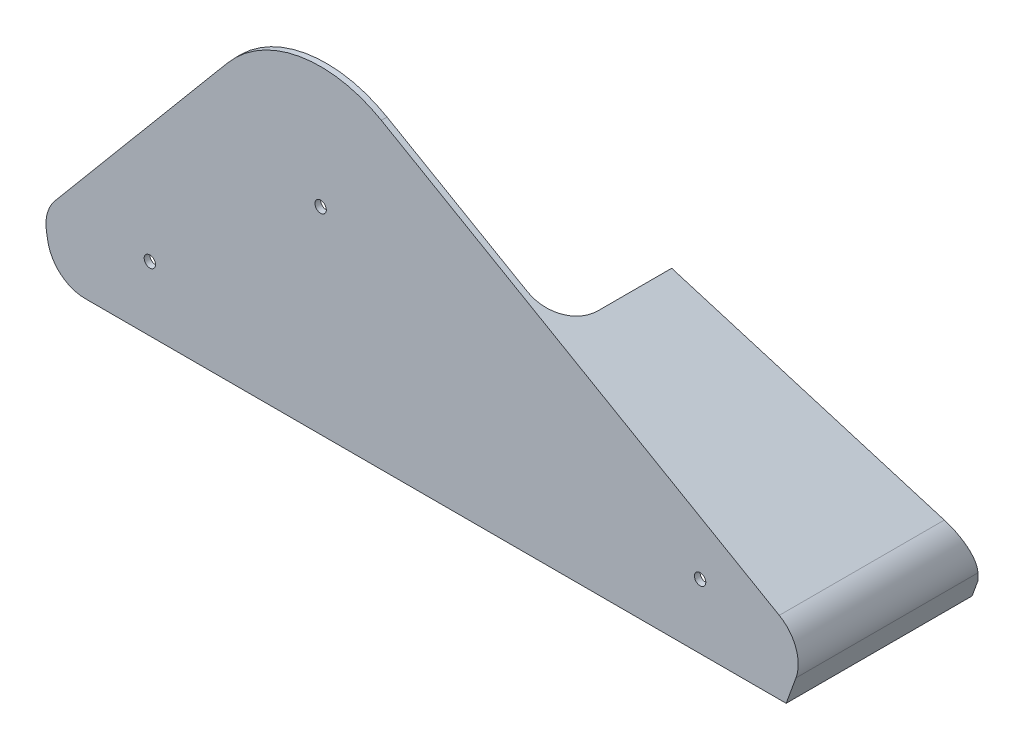
ISO-10303-21;
HEADER;
FILE_DESCRIPTION(('STEP AP214'),'2;1');
FILE_NAME('part.step','',(''),(''),'','','');
FILE_SCHEMA(('AUTOMOTIVE_DESIGN { 1 0 10303 214 1 1 1 1 }'));
ENDSEC;
DATA;
#1=APPLICATION_CONTEXT('core data for automotive mechanical design processes');
#2=APPLICATION_PROTOCOL_DEFINITION('international standard','automotive_design',2000,#1);
#3=PRODUCT_CONTEXT('',#1,'mechanical');
#4=PRODUCT('Part','Part','',(#3));
#5=PRODUCT_RELATED_PRODUCT_CATEGORY('part','',(#4));
#6=PRODUCT_DEFINITION_FORMATION('','',#4);
#7=PRODUCT_DEFINITION_CONTEXT('part definition',#1,'design');
#8=PRODUCT_DEFINITION('design','',#6,#7);
#9=PRODUCT_DEFINITION_SHAPE('','',#8);
#10=(LENGTH_UNIT() NAMED_UNIT(*) SI_UNIT(.MILLI.,.METRE.));
#11=(NAMED_UNIT(*) PLANE_ANGLE_UNIT() SI_UNIT($,.RADIAN.));
#12=(NAMED_UNIT(*) SI_UNIT($,.STERADIAN.) SOLID_ANGLE_UNIT());
#13=UNCERTAINTY_MEASURE_WITH_UNIT(LENGTH_MEASURE(1.E-05),#10,'distance_accuracy_value','');
#14=(GEOMETRIC_REPRESENTATION_CONTEXT(3) GLOBAL_UNCERTAINTY_ASSIGNED_CONTEXT((#13)) GLOBAL_UNIT_ASSIGNED_CONTEXT((#10,
#11,#12)) REPRESENTATION_CONTEXT('',''));
#15=CARTESIAN_POINT('',(0.,0.,0.));
#16=DIRECTION('',(0.,0.,1.));
#17=DIRECTION('',(1.,0.,0.));
#18=AXIS2_PLACEMENT_3D('',#15,#16,#17);
#19=CARTESIAN_POINT('',(-41.9752973417695,-243.681845607916,-46.));
#20=DIRECTION('',(0.,1.,0.));
#21=DIRECTION('',(0.,0.,-1.));
#22=AXIS2_PLACEMENT_3D('',#19,#20,#21);
#23=PLANE('',#22);
#24=DIRECTION('',(1.,0.,0.));
#25=VECTOR('',#24,1.);
#26=CARTESIAN_POINT('',(-41.9752973417695,-243.681845607916,-47.5));
#27=LINE('',#26,#25);
#28=CARTESIAN_POINT('',(-118.598691665262,-243.681845607916,-47.5));
#29=VERTEX_POINT('',#28);
#30=CARTESIAN_POINT('',(-40.3790306830556,-243.681845607916,-47.5));
#31=VERTEX_POINT('',#30);
#32=EDGE_CURVE('E218',#29,#31,#27,.T.);
#33=ORIENTED_EDGE('',*,*,#32,.T.);
#34=DIRECTION('',(0.,0.,1.));
#35=VECTOR('',#34,1.);
#36=CARTESIAN_POINT('',(-40.3790306830556,-243.681845607916,-46.));
#37=LINE('',#36,#35);
#38=CARTESIAN_POINT('',(-40.3790306830556,-243.681845607916,1.5));
#39=VERTEX_POINT('',#38);
#40=EDGE_CURVE('E230',#31,#39,#37,.T.);
#41=ORIENTED_EDGE('',*,*,#40,.T.);
#42=DIRECTION('',(1.,0.,0.));
#43=VECTOR('',#42,1.);
#44=CARTESIAN_POINT('',(-41.9752973417695,-243.681845607916,1.5));
#45=LINE('',#44,#43);
#46=CARTESIAN_POINT('',(-225.107440947825,-243.681845607916,1.5));
#47=VERTEX_POINT('',#46);
#48=EDGE_CURVE('E223',#47,#39,#45,.T.);
#49=ORIENTED_EDGE('',*,*,#48,.F.);
#50=DIRECTION('',(0.,0.,1.));
#51=VECTOR('',#50,1.);
#52=CARTESIAN_POINT('',(-225.107440947825,-243.681845607916,-46.));
#53=LINE('',#52,#51);
#54=CARTESIAN_POINT('',(-225.107440947825,-243.681845607916,0.));
#55=VERTEX_POINT('',#54);
#56=EDGE_CURVE('E261',#55,#47,#53,.T.);
#57=ORIENTED_EDGE('',*,*,#56,.F.);
#58=DIRECTION('',(1.,0.,0.));
#59=VECTOR('',#58,1.);
#60=CARTESIAN_POINT('',(-41.9752973417695,-243.681845607916,0.));
#61=LINE('',#60,#59);
#62=CARTESIAN_POINT('',(-41.9752973417695,-243.681845607916,0.));
#63=VERTEX_POINT('',#62);
#64=EDGE_CURVE('E357',#55,#63,#61,.T.);
#65=ORIENTED_EDGE('',*,*,#64,.T.);
#66=DIRECTION('',(0.,0.,1.));
#67=VECTOR('',#66,1.);
#68=CARTESIAN_POINT('',(-41.9752973417695,-243.681845607916,-46.));
#69=LINE('',#68,#67);
#70=CARTESIAN_POINT('',(-41.9752973417695,-243.681845607916,-46.));
#71=VERTEX_POINT('',#70);
#72=EDGE_CURVE('E205',#71,#63,#69,.T.);
#73=ORIENTED_EDGE('',*,*,#72,.F.);
#74=DIRECTION('',(1.,0.,0.));
#75=VECTOR('',#74,1.);
#76=CARTESIAN_POINT('',(-41.9752973417695,-243.681845607916,-46.));
#77=LINE('',#76,#75);
#78=CARTESIAN_POINT('',(-118.598691665262,-243.681845607916,-46.));
#79=VERTEX_POINT('',#78);
#80=EDGE_CURVE('E358',#79,#71,#77,.T.);
#81=ORIENTED_EDGE('',*,*,#80,.F.);
#82=DIRECTION('',(0.,0.,1.));
#83=VECTOR('',#82,1.);
#84=CARTESIAN_POINT('',(-118.598691665262,-243.681845607916,-46.));
#85=LINE('',#84,#83);
#86=EDGE_CURVE('E281',#29,#79,#85,.T.);
#87=ORIENTED_EDGE('',*,*,#86,.F.);
#88=EDGE_LOOP('',(#33,#41,#49,#57,#65,#73,#81,#87));
#89=FACE_BOUND('',#88,.T.);
#90=ADVANCED_FACE('F41',(#89),#23,.F.);
#91=CARTESIAN_POINT('',(-163.054662392863,-191.681845607916,-47.5));
#92=DIRECTION('',(0.,0.,-1.));
#93=DIRECTION('',(1.,0.,0.));
#94=AXIS2_PLACEMENT_3D('',#91,#92,#93);
#95=PLANE('',#94);
#96=DIRECTION('',(-1.,0.,0.));
#97=VECTOR('',#96,1.);
#98=CARTESIAN_POINT('',(-163.054662392863,-239.413539783714,-47.5));
#99=LINE('',#98,#97);
#100=CARTESIAN_POINT('',(-38.825494412301,-239.413539783714,-47.5));
#101=VERTEX_POINT('',#100);
#102=CARTESIAN_POINT('',(-123.544864289939,-239.413539783714,-47.5));
#103=VERTEX_POINT('',#102);
#104=EDGE_CURVE('E208',#101,#103,#99,.T.);
#105=ORIENTED_EDGE('',*,*,#104,.F.);
#106=DIRECTION('',(0.342020143325666,0.939692620785909,0.));
#107=VECTOR('',#106,1.);
#108=CARTESIAN_POINT('',(-35.358522416334,-229.888112510913,-47.5));
#109=LINE('',#108,#107);
#110=EDGE_CURVE('E226',#31,#101,#109,.T.);
#111=ORIENTED_EDGE('',*,*,#110,.F.);
#112=ORIENTED_EDGE('',*,*,#32,.F.);
#113=CARTESIAN_POINT('',(-118.598691665262,-238.681845607916,-47.5));
#114=DIRECTION('',(0.,0.,1.));
#115=DIRECTION('',(1.,0.,0.));
#116=AXIS2_PLACEMENT_3D('',#113,#114,#115);
#117=CIRCLE('',#116,5.);
#118=EDGE_CURVE('E294',#103,#29,#117,.T.);
#119=ORIENTED_EDGE('',*,*,#118,.F.);
#120=EDGE_LOOP('',(#105,#111,#112,#119));
#121=FACE_BOUND('',#120,.T.);
#122=ADVANCED_FACE('F404',(#121),#95,.T.);
#123=CARTESIAN_POINT('',(-163.054662392863,-191.681845607916,-46.));
#124=DIRECTION('',(0.,0.,1.));
#125=DIRECTION('',(-1.,0.,0.));
#126=AXIS2_PLACEMENT_3D('',#123,#124,#125);
#127=CYLINDRICAL_SURFACE('',#126,32.);
#128=CARTESIAN_POINT('',(-163.054662392863,-191.681845607916,0.));
#129=DIRECTION('',(0.,0.,1.));
#130=DIRECTION('',(1.,0.,0.));
#131=AXIS2_PLACEMENT_3D('',#128,#129,#130);
#132=CIRCLE('',#131,32.);
#133=CARTESIAN_POINT('',(-147.054662392863,-163.969032686814,0.));
#134=VERTEX_POINT('',#133);
#135=CARTESIAN_POINT('',(-187.56808457267,-171.112642097946,0.));
#136=VERTEX_POINT('',#135);
#137=EDGE_CURVE('E328',#134,#136,#132,.T.);
#138=ORIENTED_EDGE('',*,*,#137,.T.);
#139=DIRECTION('',(0.,0.,-1.));
#140=VECTOR('',#139,1.);
#141=CARTESIAN_POINT('',(-187.56808457267,-171.112642097946,-46.));
#142=LINE('',#141,#140);
#143=CARTESIAN_POINT('',(-187.56808457267,-171.112642097946,1.5));
#144=VERTEX_POINT('',#143);
#145=EDGE_CURVE('E233',#136,#144,#142,.F.);
#146=ORIENTED_EDGE('',*,*,#145,.T.);
#147=CARTESIAN_POINT('',(-163.054662392863,-191.681845607916,1.5));
#148=DIRECTION('',(0.,0.,1.));
#149=DIRECTION('',(1.,0.,0.));
#150=AXIS2_PLACEMENT_3D('',#147,#148,#149);
#151=CIRCLE('',#150,32.);
#152=CARTESIAN_POINT('',(-147.054662392863,-163.969032686814,1.5));
#153=VERTEX_POINT('',#152);
#154=EDGE_CURVE('E215',#153,#144,#151,.T.);
#155=ORIENTED_EDGE('',*,*,#154,.F.);
#156=DIRECTION('',(0.,0.,1.));
#157=VECTOR('',#156,1.);
#158=CARTESIAN_POINT('',(-147.054662392863,-163.969032686814,-46.));
#159=LINE('',#158,#157);
#160=EDGE_CURVE('E234',#134,#153,#159,.T.);
#161=ORIENTED_EDGE('',*,*,#160,.F.);
#162=EDGE_LOOP('',(#138,#146,#155,#161));
#163=FACE_BOUND('',#162,.T.);
#164=ADVANCED_FACE('F388',(#163),#127,.T.);
#165=CARTESIAN_POINT('',(-187.56808457267,-171.112642097946,-46.));
#166=DIRECTION('',(0.766044443118977,-0.642787609686541,0.));
#167=DIRECTION('',(0.642787609686541,0.766044443118977,0.));
#168=AXIS2_PLACEMENT_3D('',#165,#166,#167);
#169=PLANE('',#168);
#170=DIRECTION('',(-0.642787609686541,-0.766044443118977,0.));
#171=VECTOR('',#170,1.);
#172=CARTESIAN_POINT('',(-187.56808457267,-171.112642097946,1.5));
#173=LINE('',#172,#171);
#174=CARTESIAN_POINT('',(-233.099269712768,-225.37459556373,1.5));
#175=VERTEX_POINT('',#174);
#176=EDGE_CURVE('E377',#144,#175,#173,.T.);
#177=ORIENTED_EDGE('',*,*,#176,.F.);
#178=ORIENTED_EDGE('',*,*,#145,.F.);
#179=DIRECTION('',(-0.642787609686541,-0.766044443118977,0.));
#180=VECTOR('',#179,1.);
#181=CARTESIAN_POINT('',(-187.56808457267,-171.112642097946,0.));
#182=LINE('',#181,#180);
#183=CARTESIAN_POINT('',(-233.099269712768,-225.37459556373,0.));
#184=VERTEX_POINT('',#183);
#185=EDGE_CURVE('E331',#136,#184,#182,.T.);
#186=ORIENTED_EDGE('',*,*,#185,.T.);
#187=DIRECTION('',(0.,0.,1.));
#188=VECTOR('',#187,1.);
#189=CARTESIAN_POINT('',(-233.099269712768,-225.37459556373,-46.));
#190=LINE('',#189,#188);
#191=EDGE_CURVE('E278',#175,#184,#190,.F.);
#192=ORIENTED_EDGE('',*,*,#191,.F.);
#193=EDGE_LOOP('',(#177,#178,#186,#192));
#194=FACE_BOUND('',#193,.T.);
#195=ADVANCED_FACE('F434',(#194),#169,.F.);
#196=CARTESIAN_POINT('',(-233.452508971288,-243.942317874416,-46.));
#197=DIRECTION('',(0.984807753012209,0.173648177666926,0.));
#198=DIRECTION('',(-0.173648177666926,0.984807753012209,0.));
#199=AXIS2_PLACEMENT_3D('',#196,#197,#198);
#200=PLANE('',#199);
#201=DIRECTION('',(0.173648177666926,-0.984807753012209,0.));
#202=VECTOR('',#201,1.);
#203=CARTESIAN_POINT('',(-233.452508971288,-243.942317874416,1.5));
#204=LINE('',#203,#202);
#205=CARTESIAN_POINT('',(-235.286902811701,-233.538953437264,1.5));
#206=VERTEX_POINT('',#205);
#207=CARTESIAN_POINT('',(-234.955518477947,-235.418327384585,1.5));
#208=VERTEX_POINT('',#207);
#209=EDGE_CURVE('E229',#206,#208,#204,.T.);
#210=ORIENTED_EDGE('',*,*,#209,.F.);
#211=DIRECTION('',(0.,0.,1.));
#212=VECTOR('',#211,1.);
#213=CARTESIAN_POINT('',(-235.286902811701,-233.538953437264,-46.));
#214=LINE('',#213,#212);
#215=CARTESIAN_POINT('',(-235.286902811701,-233.538953437264,0.));
#216=VERTEX_POINT('',#215);
#217=EDGE_CURVE('E268',#216,#206,#214,.T.);
#218=ORIENTED_EDGE('',*,*,#217,.F.);
#219=DIRECTION('',(0.173648177666927,-0.984807753012209,0.));
#220=VECTOR('',#219,1.);
#221=CARTESIAN_POINT('',(-240.266821263985,-205.296432455643,0.));
#222=LINE('',#221,#220);
#223=CARTESIAN_POINT('',(-234.955518477947,-235.418327384585,0.));
#224=VERTEX_POINT('',#223);
#225=EDGE_CURVE('E334',#216,#224,#222,.T.);
#226=ORIENTED_EDGE('',*,*,#225,.T.);
#227=DIRECTION('',(0.,0.,1.));
#228=VECTOR('',#227,1.);
#229=CARTESIAN_POINT('',(-234.955518477947,-235.418327384585,-46.));
#230=LINE('',#229,#228);
#231=EDGE_CURVE('E271',#208,#224,#230,.F.);
#232=ORIENTED_EDGE('',*,*,#231,.F.);
#233=EDGE_LOOP('',(#210,#218,#226,#232));
#234=FACE_BOUND('',#233,.T.);
#235=ADVANCED_FACE('F441',(#234),#200,.F.);
#236=CARTESIAN_POINT('',(-147.054662392863,-163.969032686814,-46.));
#237=DIRECTION('',(-0.499999999999998,-0.86602540378444,0.));
#238=DIRECTION('',(0.86602540378444,-0.499999999999998,0.));
#239=AXIS2_PLACEMENT_3D('',#236,#237,#238);
#240=PLANE('',#239);
#241=DIRECTION('',(-0.86602540378444,0.499999999999998,0.));
#242=VECTOR('',#241,1.);
#243=CARTESIAN_POINT('',(-147.054662392863,-163.969032686814,0.));
#244=LINE('',#243,#242);
#245=CARTESIAN_POINT('',(-110.064861814121,-185.325104008221,0.));
#246=VERTEX_POINT('',#245);
#247=EDGE_CURVE('E191',#246,#134,#244,.T.);
#248=ORIENTED_EDGE('',*,*,#247,.T.);
#249=ORIENTED_EDGE('',*,*,#160,.T.);
#250=DIRECTION('',(-0.86602540378444,0.499999999999998,0.));
#251=VECTOR('',#250,1.);
#252=CARTESIAN_POINT('',(-147.054662392863,-163.969032686814,1.5));
#253=LINE('',#252,#251);
#254=CARTESIAN_POINT('',(-42.1948549212111,-224.509870757744,1.5));
#255=VERTEX_POINT('',#254);
#256=EDGE_CURVE('E217',#255,#153,#253,.T.);
#257=ORIENTED_EDGE('',*,*,#256,.F.);
#258=DIRECTION('',(0.,0.,1.));
#259=VECTOR('',#258,1.);
#260=CARTESIAN_POINT('',(-42.1948549212111,-224.509870757744,-46.));
#261=LINE('',#260,#259);
#262=CARTESIAN_POINT('',(-42.1948549212111,-224.509870757744,-41.9921223164894));
#263=VERTEX_POINT('',#262);
#264=EDGE_CURVE('E203',#263,#255,#261,.T.);
#265=ORIENTED_EDGE('',*,*,#264,.F.);
#266=DIRECTION('',(-0.851608514271017,0.491676404958546,0.18170649748468));
#267=VECTOR('',#266,1.);
#268=CARTESIAN_POINT('',(-142.972289569604,-166.325991735255,-20.4893844168738));
#269=LINE('',#268,#267);
#270=CARTESIAN_POINT('',(-101.404607776277,-190.325104008221,-29.3586215612309));
#271=VERTEX_POINT('',#270);
#272=EDGE_CURVE('E186',#263,#271,#269,.T.);
#273=ORIENTED_EDGE('',*,*,#272,.T.);
#274=DIRECTION('',(0.,0.,1.));
#275=VECTOR('',#274,1.);
#276=CARTESIAN_POINT('',(-101.404607776277,-190.325104008221,-34.8107421787631));
#277=LINE('',#276,#275);
#278=CARTESIAN_POINT('',(-101.404607776277,-190.325104008221,-10.));
#279=VERTEX_POINT('',#278);
#280=EDGE_CURVE('E192',#271,#279,#277,.T.);
#281=ORIENTED_EDGE('',*,*,#280,.T.);
#282=CARTESIAN_POINT('',(-110.064861814121,-185.325104008221,-10.));
#283=DIRECTION('',(0.499999999999998,0.86602540378444,0.));
#284=DIRECTION('',(0.86602540378444,-0.499999999999998,0.));
#285=AXIS2_PLACEMENT_3D('',#282,#283,#284);
#286=CIRCLE('',#285,10.);
#287=EDGE_CURVE('E50',#246,#279,#286,.T.);
#288=ORIENTED_EDGE('',*,*,#287,.F.);
#289=EDGE_LOOP('',(#248,#249,#257,#265,#273,#281,#288));
#290=FACE_BOUND('',#289,.T.);
#291=ADVANCED_FACE('F200',(#290),#240,.F.);
#292=CARTESIAN_POINT('',(0.,-13.3245376288953,36.0546312311286));
#293=DIRECTION('',(0.,0.346650140871629,-0.937994498829113));
#294=DIRECTION('',(0.,-0.937994498829113,-0.346650140871629));
#295=AXIS2_PLACEMENT_3D('',#292,#293,#294);
#296=PLANE('',#295);
#297=CARTESIAN_POINT('',(-102.379030683056,-225.091952914172,-42.2072396351692));
#298=DIRECTION('',(0.,-0.346650140871629,0.937994498829113));
#299=DIRECTION('',(0.,-0.937994498829113,-0.346650140871629));
#300=AXIS2_PLACEMENT_3D('',#297,#298,#299);
#301=CIRCLE('',#300,1.5);
#302=CARTESIAN_POINT('',(-102.379030683056,-226.498944662415,-42.7272148464767));
#303=VERTEX_POINT('',#302);
#304=EDGE_CURVE('E325',#303,#303,#301,.T.);
#305=ORIENTED_EDGE('',*,*,#304,.T.);
#306=EDGE_LOOP('',(#305));
#307=FACE_BOUND('',#306,.T.);
#308=DIRECTION('',(0.476204765262695,0.824810848241403,0.304821400437041));
#309=VECTOR('',#308,1.);
#310=CARTESIAN_POINT('',(0.608312315265829,-13.6335433812033,35.9404334531017));
#311=LINE('',#310,#309);
#312=CARTESIAN_POINT('',(-102.154607776277,-191.624142113897,-29.8387008611548));
#313=VERTEX_POINT('',#312);
#314=EDGE_CURVE('E182',#313,#271,#311,.T.);
#315=ORIENTED_EDGE('',*,*,#314,.T.);
#316=ORIENTED_EDGE('',*,*,#272,.F.);
#317=CARTESIAN_POINT('',(-47.1948549212111,-233.170124795588,-45.1926509826494));
#318=DIRECTION('',(0.,-0.346650140871629,0.937994498829113));
#319=DIRECTION('',(0.,0.937994498829113,0.346650140871629));
#320=AXIS2_PLACEMENT_3D('',#317,#318,#319);
#321=ELLIPSE('',#320,10.6610433349906,10.);
#322=CARTESIAN_POINT('',(-37.797928713352,-236.590326228845,-46.4566384688529));
#323=VERTEX_POINT('',#322);
#324=EDGE_CURVE('E259',#323,#263,#321,.T.);
#325=ORIENTED_EDGE('',*,*,#324,.F.);
#326=DIRECTION('',(0.323091866740261,0.887687608278315,0.328058463928943));
#327=VECTOR('',#326,1.);
#328=CARTESIAN_POINT('',(-35.5726565776119,-230.476441283757,-44.1971592500162));
#329=LINE('',#328,#327);
#330=EDGE_CURVE('E204',#101,#323,#329,.T.);
#331=ORIENTED_EDGE('',*,*,#330,.F.);
#332=ORIENTED_EDGE('',*,*,#104,.T.);
#333=CARTESIAN_POINT('',(-118.598691665262,-238.681845607916,-47.2295912828573));
#334=DIRECTION('',(0.,-0.346650140871629,0.937994498829113));
#335=DIRECTION('',(0.,-0.937994498829113,-0.346650140871629));
#336=AXIS2_PLACEMENT_3D('',#333,#334,#335);
#337=ELLIPSE('',#336,5.33052166749532,5.);
#338=CARTESIAN_POINT('',(-122.928818684184,-236.181845607916,-46.305678239379));
#339=VERTEX_POINT('',#338);
#340=EDGE_CURVE('E292',#339,#103,#337,.T.);
#341=ORIENTED_EDGE('',*,*,#340,.F.);
#342=DIRECTION('',(-0.476204765262695,-0.824810848241403,-0.304821400437041));
#343=VECTOR('',#342,1.);
#344=CARTESIAN_POINT('',(4.4367170414046,-15.5782665979658,35.221731394733));
#345=LINE('',#344,#343);
#346=CARTESIAN_POINT('',(-103.69121437715,-202.861337532227,-33.9915774287983));
#347=VERTEX_POINT('',#346);
#348=EDGE_CURVE('E342',#347,#339,#345,.T.);
#349=ORIENTED_EDGE('',*,*,#348,.F.);
#350=CARTESIAN_POINT('',(-116.681595433917,-195.361337532227,-31.2198382983636));
#351=DIRECTION('',(0.,-0.346650140871629,0.937994498829113));
#352=DIRECTION('',(0.,0.937994498829113,0.346650140871629));
#353=AXIS2_PLACEMENT_3D('',#350,#351,#352);
#354=ELLIPSE('',#353,15.9915650024859,15.);
#355=EDGE_CURVE('E190',#313,#347,#354,.F.);
#356=ORIENTED_EDGE('',*,*,#355,.F.);
#357=EDGE_LOOP('',(#315,#316,#325,#331,#332,#341,#349,#356));
#358=FACE_BOUND('',#357,.T.);
#359=ADVANCED_FACE('F183',(#307,#358),#296,.T.);
#360=CARTESIAN_POINT('',(-163.054662392863,-191.681845607916,-46.));
#361=DIRECTION('',(0.,0.,-1.));
#362=DIRECTION('',(1.,0.,0.));
#363=AXIS2_PLACEMENT_3D('',#360,#361,#362);
#364=PLANE('',#363);
#365=ORIENTED_EDGE('',*,*,#80,.T.);
#366=DIRECTION('',(0.342020143325666,0.939692620785909,0.));
#367=VECTOR('',#366,1.);
#368=CARTESIAN_POINT('',(-36.7680613475128,-229.375082295924,-46.));
#369=LINE('',#368,#367);
#370=CARTESIAN_POINT('',(-40.5194164047047,-239.681845607916,-46.));
#371=VERTEX_POINT('',#370);
#372=EDGE_CURVE('E211',#71,#371,#369,.T.);
#373=ORIENTED_EDGE('',*,*,#372,.T.);
#374=DIRECTION('',(-1.,0.,0.));
#375=VECTOR('',#374,1.);
#376=CARTESIAN_POINT('',(-163.054662392863,-239.681845607916,-46.));
#377=LINE('',#376,#375);
#378=CARTESIAN_POINT('',(-123.497671150828,-239.681845607916,-46.));
#379=VERTEX_POINT('',#378);
#380=EDGE_CURVE('E351',#371,#379,#377,.T.);
#381=ORIENTED_EDGE('',*,*,#380,.T.);
#382=CARTESIAN_POINT('',(-118.598691665262,-238.681845607916,-46.));
#383=DIRECTION('',(0.,0.,1.));
#384=DIRECTION('',(1.,0.,0.));
#385=AXIS2_PLACEMENT_3D('',#382,#383,#384);
#386=CIRCLE('',#385,5.);
#387=EDGE_CURVE('E284',#79,#379,#386,.F.);
#388=ORIENTED_EDGE('',*,*,#387,.F.);
#389=EDGE_LOOP('',(#365,#373,#381,#388));
#390=FACE_BOUND('',#389,.T.);
#391=ADVANCED_FACE('F412',(#390),#364,.F.);
#392=CARTESIAN_POINT('',(-147.804662392863,-165.26807079249,-46.));
#393=DIRECTION('',(-0.499999999999998,-0.86602540378444,0.));
#394=DIRECTION('',(0.86602540378444,-0.499999999999998,0.));
#395=AXIS2_PLACEMENT_3D('',#392,#393,#394);
#396=PLANE('',#395);
#397=DIRECTION('',(-0.86602540378444,0.499999999999998,0.));
#398=VECTOR('',#397,1.);
#399=CARTESIAN_POINT('',(-147.804662392863,-165.26807079249,0.));
#400=LINE('',#399,#398);
#401=CARTESIAN_POINT('',(-44.0348773165696,-225.179584140038,0.));
#402=VERTEX_POINT('',#401);
#403=CARTESIAN_POINT('',(-110.814861814121,-186.624142113897,0.));
#404=VERTEX_POINT('',#403);
#405=EDGE_CURVE('E361',#402,#404,#400,.T.);
#406=ORIENTED_EDGE('',*,*,#405,.T.);
#407=CARTESIAN_POINT('',(-110.814861814121,-186.624142113897,-10.));
#408=DIRECTION('',(0.499999999999998,0.86602540378444,0.));
#409=DIRECTION('',(0.86602540378444,-0.499999999999998,0.));
#410=AXIS2_PLACEMENT_3D('',#407,#408,#409);
#411=CIRCLE('',#410,10.);
#412=CARTESIAN_POINT('',(-102.154607776277,-191.624142113897,-10.));
#413=VERTEX_POINT('',#412);
#414=EDGE_CURVE('E11',#413,#404,#411,.F.);
#415=ORIENTED_EDGE('',*,*,#414,.F.);
#416=DIRECTION('',(0.,0.,1.));
#417=VECTOR('',#416,1.);
#418=CARTESIAN_POINT('',(-102.154607776277,-191.624142113897,-47.5));
#419=LINE('',#418,#417);
#420=CARTESIAN_POINT('',(-102.154607776277,-191.624142113897,-28.2395443609062));
#421=VERTEX_POINT('',#420);
#422=EDGE_CURVE('E339',#421,#413,#419,.T.);
#423=ORIENTED_EDGE('',*,*,#422,.F.);
#424=DIRECTION('',(-0.851608514271017,0.491676404958546,0.18170649748468));
#425=VECTOR('',#424,1.);
#426=CARTESIAN_POINT('',(-143.549120429811,-167.725009090406,-19.407256069616));
#427=LINE('',#426,#425);
#428=CARTESIAN_POINT('',(-44.0348773165697,-225.179584140038,-40.6404685879581));
#429=VERTEX_POINT('',#428);
#430=EDGE_CURVE('E345',#429,#421,#427,.T.);
#431=ORIENTED_EDGE('',*,*,#430,.F.);
#432=DIRECTION('',(0.,0.,1.));
#433=VECTOR('',#432,1.);
#434=CARTESIAN_POINT('',(-44.0348773165696,-225.179584140038,-42.1909787760031));
#435=LINE('',#434,#433);
#436=EDGE_CURVE('E249',#402,#429,#435,.F.);
#437=ORIENTED_EDGE('',*,*,#436,.F.);
#438=EDGE_LOOP('',(#406,#415,#423,#431,#437));
#439=FACE_BOUND('',#438,.T.);
#440=ADVANCED_FACE('F426',(#439),#396,.T.);
#441=CARTESIAN_POINT('',(-163.054662392863,-191.681845607916,-46.));
#442=DIRECTION('',(0.,0.,1.));
#443=DIRECTION('',(-1.,0.,0.));
#444=AXIS2_PLACEMENT_3D('',#441,#442,#443);
#445=CYLINDRICAL_SURFACE('',#444,1.5);
#446=CARTESIAN_POINT('',(-163.054662392863,-191.681845607916,1.5));
#447=DIRECTION('',(0.,0.,1.));
#448=DIRECTION('',(1.,0.,0.));
#449=AXIS2_PLACEMENT_3D('',#446,#447,#448);
#450=CIRCLE('',#449,1.5);
#451=CARTESIAN_POINT('',(-161.554662392863,-191.681845607916,1.5));
#452=VERTEX_POINT('',#451);
#453=EDGE_CURVE('E235',#452,#452,#450,.T.);
#454=ORIENTED_EDGE('',*,*,#453,.T.);
#455=EDGE_LOOP('',(#454));
#456=FACE_BOUND('',#455,.T.);
#457=CARTESIAN_POINT('',(-163.054662392863,-191.681845607916,0.));
#458=DIRECTION('',(0.,0.,1.));
#459=DIRECTION('',(1.,0.,0.));
#460=AXIS2_PLACEMENT_3D('',#457,#458,#459);
#461=CIRCLE('',#460,1.5);
#462=CARTESIAN_POINT('',(-161.554662392863,-191.681845607916,0.));
#463=VERTEX_POINT('',#462);
#464=EDGE_CURVE('E354',#463,#463,#461,.T.);
#465=ORIENTED_EDGE('',*,*,#464,.F.);
#466=EDGE_LOOP('',(#465));
#467=FACE_BOUND('',#466,.T.);
#468=ADVANCED_FACE('F468',(#456,#467),#445,.F.);
#469=CARTESIAN_POINT('',(-35.358522416334,-229.888112510913,-46.));
#470=DIRECTION('',(-0.939692620785909,0.342020143325666,0.));
#471=DIRECTION('',(-0.342020143325666,-0.939692620785909,0.));
#472=AXIS2_PLACEMENT_3D('',#469,#470,#471);
#473=PLANE('',#472);
#474=DIRECTION('',(0.342020143325666,0.939692620785909,0.));
#475=VECTOR('',#474,1.);
#476=CARTESIAN_POINT('',(-35.358522416334,-229.888112510913,1.5));
#477=LINE('',#476,#475);
#478=CARTESIAN_POINT('',(-37.797928713352,-236.590326228845,1.5));
#479=VERTEX_POINT('',#478);
#480=EDGE_CURVE('E219',#39,#479,#477,.T.);
#481=ORIENTED_EDGE('',*,*,#480,.F.);
#482=ORIENTED_EDGE('',*,*,#40,.F.);
#483=ORIENTED_EDGE('',*,*,#110,.T.);
#484=ORIENTED_EDGE('',*,*,#330,.T.);
#485=DIRECTION('',(0.,0.,1.));
#486=VECTOR('',#485,1.);
#487=CARTESIAN_POINT('',(-37.797928713352,-236.590326228845,-46.));
#488=LINE('',#487,#486);
#489=EDGE_CURVE('E257',#479,#323,#488,.F.);
#490=ORIENTED_EDGE('',*,*,#489,.F.);
#491=EDGE_LOOP('',(#481,#482,#483,#484,#490));
#492=FACE_BOUND('',#491,.T.);
#493=ADVANCED_FACE('F400',(#492),#473,.F.);
#494=CARTESIAN_POINT('',(-163.054662392863,-191.681845607916,1.5));
#495=DIRECTION('',(0.,0.,-1.));
#496=DIRECTION('',(1.,0.,0.));
#497=AXIS2_PLACEMENT_3D('',#494,#495,#496);
#498=PLANE('',#497);
#499=CARTESIAN_POINT('',(-208.054662392863,-226.681845607916,1.5));
#500=DIRECTION('',(0.,0.,-1.));
#501=DIRECTION('',(-1.,0.,0.));
#502=AXIS2_PLACEMENT_3D('',#499,#500,#501);
#503=CIRCLE('',#502,1.5);
#504=CARTESIAN_POINT('',(-209.554662392863,-226.681845607916,1.5));
#505=VERTEX_POINT('',#504);
#506=EDGE_CURVE('E304',#505,#505,#503,.T.);
#507=ORIENTED_EDGE('',*,*,#506,.T.);
#508=EDGE_LOOP('',(#507));
#509=FACE_BOUND('',#508,.T.);
#510=CARTESIAN_POINT('',(-63.0546623928632,-226.681845607916,1.5));
#511=DIRECTION('',(0.,0.,-1.));
#512=DIRECTION('',(-1.,0.,0.));
#513=AXIS2_PLACEMENT_3D('',#510,#511,#512);
#514=CIRCLE('',#513,1.5);
#515=CARTESIAN_POINT('',(-64.5546623928632,-226.681845607916,1.5));
#516=VERTEX_POINT('',#515);
#517=EDGE_CURVE('E320',#516,#516,#514,.T.);
#518=ORIENTED_EDGE('',*,*,#517,.T.);
#519=EDGE_LOOP('',(#518));
#520=FACE_BOUND('',#519,.T.);
#521=ORIENTED_EDGE('',*,*,#48,.T.);
#522=ORIENTED_EDGE('',*,*,#480,.T.);
#523=CARTESIAN_POINT('',(-47.1948549212111,-233.170124795588,1.5));
#524=DIRECTION('',(0.,0.,1.));
#525=DIRECTION('',(1.,0.,0.));
#526=AXIS2_PLACEMENT_3D('',#523,#524,#525);
#527=CIRCLE('',#526,10.);
#528=EDGE_CURVE('E255',#255,#479,#527,.F.);
#529=ORIENTED_EDGE('',*,*,#528,.F.);
#530=ORIENTED_EDGE('',*,*,#256,.T.);
#531=ORIENTED_EDGE('',*,*,#154,.T.);
#532=ORIENTED_EDGE('',*,*,#176,.T.);
#533=CARTESIAN_POINT('',(-225.438825281578,-231.802471660595,1.5));
#534=DIRECTION('',(0.,0.,1.));
#535=DIRECTION('',(1.,0.,0.));
#536=AXIS2_PLACEMENT_3D('',#533,#534,#535);
#537=CIRCLE('',#536,10.);
#538=EDGE_CURVE('E264',#206,#175,#537,.F.);
#539=ORIENTED_EDGE('',*,*,#538,.F.);
#540=ORIENTED_EDGE('',*,*,#209,.T.);
#541=CARTESIAN_POINT('',(-225.107440947825,-233.681845607916,1.5));
#542=DIRECTION('',(0.,0.,1.));
#543=DIRECTION('',(1.,0.,0.));
#544=AXIS2_PLACEMENT_3D('',#541,#542,#543);
#545=CIRCLE('',#544,10.);
#546=EDGE_CURVE('E266',#47,#208,#545,.F.);
#547=ORIENTED_EDGE('',*,*,#546,.F.);
#548=EDGE_LOOP('',(#521,#522,#529,#530,#531,#532,#539,#540,#547));
#549=FACE_BOUND('',#548,.T.);
#550=ORIENTED_EDGE('',*,*,#453,.F.);
#551=EDGE_LOOP('',(#550));
#552=FACE_BOUND('',#551,.T.);
#553=ADVANCED_FACE('F391',(#509,#520,#549,#552),#498,.F.);
#554=CARTESIAN_POINT('',(-36.7680613475128,-229.375082295924,-46.));
#555=DIRECTION('',(-0.939692620785909,0.342020143325666,0.));
#556=DIRECTION('',(-0.342020143325666,-0.939692620785909,0.));
#557=AXIS2_PLACEMENT_3D('',#554,#555,#556);
#558=PLANE('',#557);
#559=DIRECTION('',(0.323091866740261,0.887687608278315,0.328058463928943));
#560=VECTOR('',#559,1.);
#561=CARTESIAN_POINT('',(-37.1717910160428,-230.484320443774,-42.600914613252));
#562=LINE('',#561,#560);
#563=CARTESIAN_POINT('',(-39.6379511087105,-237.260039611139,-45.1049847403215));
#564=VERTEX_POINT('',#563);
#565=EDGE_CURVE('E348',#371,#564,#562,.T.);
#566=ORIENTED_EDGE('',*,*,#565,.F.);
#567=ORIENTED_EDGE('',*,*,#372,.F.);
#568=ORIENTED_EDGE('',*,*,#72,.T.);
#569=DIRECTION('',(0.342020143325666,0.939692620785909,0.));
#570=VECTOR('',#569,1.);
#571=CARTESIAN_POINT('',(-36.7680613475128,-229.375082295924,0.));
#572=LINE('',#571,#570);
#573=CARTESIAN_POINT('',(-39.6379511087105,-237.260039611139,0.));
#574=VERTEX_POINT('',#573);
#575=EDGE_CURVE('E366',#63,#574,#572,.T.);
#576=ORIENTED_EDGE('',*,*,#575,.T.);
#577=DIRECTION('',(0.,0.,1.));
#578=VECTOR('',#577,1.);
#579=CARTESIAN_POINT('',(-39.6379511087105,-237.260039611139,0.));
#580=LINE('',#579,#578);
#581=EDGE_CURVE('E244',#564,#574,#580,.T.);
#582=ORIENTED_EDGE('',*,*,#581,.F.);
#583=EDGE_LOOP('',(#566,#567,#568,#576,#582));
#584=FACE_BOUND('',#583,.T.);
#585=ADVANCED_FACE('F449',(#584),#558,.T.);
#586=CARTESIAN_POINT('',(-163.054662392863,-191.681845607916,0.));
#587=DIRECTION('',(0.,0.,-1.));
#588=DIRECTION('',(1.,0.,0.));
#589=AXIS2_PLACEMENT_3D('',#586,#587,#588);
#590=PLANE('',#589);
#591=CARTESIAN_POINT('',(-208.054662392863,-226.681845607916,0.));
#592=DIRECTION('',(0.,0.,1.));
#593=DIRECTION('',(1.,0.,0.));
#594=AXIS2_PLACEMENT_3D('',#591,#592,#593);
#595=CIRCLE('',#594,1.5);
#596=CARTESIAN_POINT('',(-206.554662392863,-226.681845607916,0.));
#597=VERTEX_POINT('',#596);
#598=EDGE_CURVE('E198',#597,#597,#595,.T.);
#599=ORIENTED_EDGE('',*,*,#598,.T.);
#600=EDGE_LOOP('',(#599));
#601=FACE_BOUND('',#600,.T.);
#602=CARTESIAN_POINT('',(-63.0546623928632,-226.681845607916,0.));
#603=DIRECTION('',(0.,0.,1.));
#604=DIRECTION('',(1.,0.,0.));
#605=AXIS2_PLACEMENT_3D('',#602,#603,#604);
#606=CIRCLE('',#605,1.5);
#607=CARTESIAN_POINT('',(-61.5546623928632,-226.681845607916,0.));
#608=VERTEX_POINT('',#607);
#609=EDGE_CURVE('E302',#608,#608,#606,.T.);
#610=ORIENTED_EDGE('',*,*,#609,.T.);
#611=EDGE_LOOP('',(#610));
#612=FACE_BOUND('',#611,.T.);
#613=ORIENTED_EDGE('',*,*,#405,.F.);
#614=CARTESIAN_POINT('',(-49.0348773165696,-233.839838177882,0.));
#615=DIRECTION('',(0.,0.,1.));
#616=DIRECTION('',(1.,0.,0.));
#617=AXIS2_PLACEMENT_3D('',#614,#615,#616);
#618=CIRCLE('',#617,10.);
#619=EDGE_CURVE('E247',#574,#402,#618,.T.);
#620=ORIENTED_EDGE('',*,*,#619,.F.);
#621=ORIENTED_EDGE('',*,*,#575,.F.);
#622=ORIENTED_EDGE('',*,*,#64,.F.);
#623=CARTESIAN_POINT('',(-225.107440947825,-233.681845607916,0.));
#624=DIRECTION('',(0.,0.,1.));
#625=DIRECTION('',(1.,0.,0.));
#626=AXIS2_PLACEMENT_3D('',#623,#624,#625);
#627=CIRCLE('',#626,10.);
#628=EDGE_CURVE('E276',#224,#55,#627,.T.);
#629=ORIENTED_EDGE('',*,*,#628,.F.);
#630=ORIENTED_EDGE('',*,*,#225,.F.);
#631=CARTESIAN_POINT('',(-225.438825281578,-231.802471660595,0.));
#632=DIRECTION('',(0.,0.,1.));
#633=DIRECTION('',(1.,0.,0.));
#634=AXIS2_PLACEMENT_3D('',#631,#632,#633);
#635=CIRCLE('',#634,10.);
#636=EDGE_CURVE('E274',#184,#216,#635,.T.);
#637=ORIENTED_EDGE('',*,*,#636,.F.);
#638=ORIENTED_EDGE('',*,*,#185,.F.);
#639=ORIENTED_EDGE('',*,*,#137,.F.);
#640=ORIENTED_EDGE('',*,*,#247,.F.);
#641=DIRECTION('',(0.499999999999998,0.86602540378444,0.));
#642=VECTOR('',#641,1.);
#643=CARTESIAN_POINT('',(-126.064861814121,-213.037916929323,0.));
#644=LINE('',#643,#642);
#645=EDGE_CURVE('E298',#404,#246,#644,.T.);
#646=ORIENTED_EDGE('',*,*,#645,.F.);
#647=EDGE_LOOP('',(#613,#620,#621,#622,#629,#630,#637,#638,#639,#640,#646));
#648=FACE_BOUND('',#647,.T.);
#649=ORIENTED_EDGE('',*,*,#464,.T.);
#650=EDGE_LOOP('',(#649));
#651=FACE_BOUND('',#650,.T.);
#652=ADVANCED_FACE('F308',(#601,#612,#648,#651),#590,.T.);
#653=CARTESIAN_POINT('',(0.,-13.8445128402028,37.4616229793722));
#654=DIRECTION('',(0.,0.346650140871629,-0.937994498829113));
#655=DIRECTION('',(0.,-0.937994498829113,-0.346650140871629));
#656=AXIS2_PLACEMENT_3D('',#653,#654,#655);
#657=PLANE('',#656);
#658=CARTESIAN_POINT('',(-102.379030683056,-225.611928125479,-40.8002478869255));
#659=DIRECTION('',(0.,-0.346650140871629,0.937994498829113));
#660=DIRECTION('',(0.,-0.937994498829113,-0.346650140871629));
#661=AXIS2_PLACEMENT_3D('',#658,#659,#660);
#662=CIRCLE('',#661,1.5);
#663=CARTESIAN_POINT('',(-102.379030683056,-227.018919873723,-41.320223098233));
#664=VERTEX_POINT('',#663);
#665=EDGE_CURVE('E45',#664,#664,#662,.T.);
#666=ORIENTED_EDGE('',*,*,#665,.F.);
#667=EDGE_LOOP('',(#666));
#668=FACE_BOUND('',#667,.T.);
#669=ORIENTED_EDGE('',*,*,#380,.F.);
#670=ORIENTED_EDGE('',*,*,#565,.T.);
#671=CARTESIAN_POINT('',(-49.0348773165696,-233.839838177882,-43.840997254118));
#672=DIRECTION('',(0.,-0.346650140871629,0.937994498829113));
#673=DIRECTION('',(0.,-0.937994498829113,-0.346650140871629));
#674=AXIS2_PLACEMENT_3D('',#671,#672,#673);
#675=ELLIPSE('',#674,10.6610433349906,10.);
#676=EDGE_CURVE('E252',#429,#564,#675,.F.);
#677=ORIENTED_EDGE('',*,*,#676,.F.);
#678=ORIENTED_EDGE('',*,*,#430,.T.);
#679=CARTESIAN_POINT('',(-116.681595433917,-195.361337532227,-29.620681798115));
#680=DIRECTION('',(0.,-0.346650140871629,0.937994498829113));
#681=DIRECTION('',(0.,0.937994498829113,0.346650140871629));
#682=AXIS2_PLACEMENT_3D('',#679,#680,#681);
#683=ELLIPSE('',#682,15.9915650024859,15.);
#684=CARTESIAN_POINT('',(-103.69121437715,-202.861337532227,-32.3924209285497));
#685=VERTEX_POINT('',#684);
#686=EDGE_CURVE('E238',#421,#685,#683,.F.);
#687=ORIENTED_EDGE('',*,*,#686,.T.);
#688=DIRECTION('',(-0.476204765262695,-0.824810848241403,-0.304821400437041));
#689=VECTOR('',#688,1.);
#690=CARTESIAN_POINT('',(4.20458763613085,-15.9803265218306,36.6723005318141));
#691=LINE('',#690,#689);
#692=CARTESIAN_POINT('',(-122.928818684184,-236.181845607916,-44.7065217391304));
#693=VERTEX_POINT('',#692);
#694=EDGE_CURVE('E241',#685,#693,#691,.T.);
#695=ORIENTED_EDGE('',*,*,#694,.T.);
#696=CARTESIAN_POINT('',(-118.598691665262,-238.681845607916,-45.6304347826087));
#697=DIRECTION('',(0.,-0.346650140871629,0.937994498829113));
#698=DIRECTION('',(0.,-0.937994498829113,-0.346650140871629));
#699=AXIS2_PLACEMENT_3D('',#696,#697,#698);
#700=ELLIPSE('',#699,5.33052166749532,5.);
#701=EDGE_CURVE('E287',#379,#693,#700,.F.);
#702=ORIENTED_EDGE('',*,*,#701,.F.);
#703=EDGE_LOOP('',(#669,#670,#677,#678,#687,#695,#702));
#704=FACE_BOUND('',#703,.T.);
#705=ADVANCED_FACE('F416',(#668,#704),#657,.F.);
#706=CARTESIAN_POINT('',(-113.69121437715,-220.181845607916,-47.5));
#707=DIRECTION('',(-0.86602540378444,0.499999999999998,0.));
#708=DIRECTION('',(-0.499999999999998,-0.86602540378444,0.));
#709=AXIS2_PLACEMENT_3D('',#706,#707,#708);
#710=PLANE('',#709);
#711=ORIENTED_EDGE('',*,*,#694,.F.);
#712=DIRECTION('',(0.,0.,1.));
#713=VECTOR('',#712,1.);
#714=CARTESIAN_POINT('',(-103.69121437715,-202.861337532227,-47.5));
#715=LINE('',#714,#713);
#716=EDGE_CURVE('E337',#347,#685,#715,.T.);
#717=ORIENTED_EDGE('',*,*,#716,.F.);
#718=ORIENTED_EDGE('',*,*,#348,.T.);
#719=DIRECTION('',(0.,0.,1.));
#720=VECTOR('',#719,1.);
#721=CARTESIAN_POINT('',(-122.928818684184,-236.181845607916,-47.5));
#722=LINE('',#721,#720);
#723=EDGE_CURVE('E290',#693,#339,#722,.F.);
#724=ORIENTED_EDGE('',*,*,#723,.F.);
#725=EDGE_LOOP('',(#711,#717,#718,#724));
#726=FACE_BOUND('',#725,.T.);
#727=ADVANCED_FACE('F419',(#726),#710,.T.);
#728=CARTESIAN_POINT('',(-116.681595433917,-195.361337532227,-47.5));
#729=DIRECTION('',(0.,0.,1.));
#730=DIRECTION('',(-1.,0.,0.));
#731=AXIS2_PLACEMENT_3D('',#728,#729,#730);
#732=CYLINDRICAL_SURFACE('',#731,15.);
#733=DIRECTION('',(0.,0.,1.));
#734=VECTOR('',#733,1.);
#735=CARTESIAN_POINT('',(-102.154607776277,-191.624142113897,-47.5));
#736=LINE('',#735,#734);
#737=EDGE_CURVE('E296',#421,#313,#736,.F.);
#738=ORIENTED_EDGE('',*,*,#737,.T.);
#739=ORIENTED_EDGE('',*,*,#355,.T.);
#740=ORIENTED_EDGE('',*,*,#716,.T.);
#741=ORIENTED_EDGE('',*,*,#686,.F.);
#742=EDGE_LOOP('',(#738,#739,#740,#741));
#743=FACE_BOUND('',#742,.T.);
#744=ADVANCED_FACE('F421',(#743),#732,.F.);
#745=CARTESIAN_POINT('',(-49.0348773165696,-233.839838177882,-46.));
#746=DIRECTION('',(0.,0.,-1.));
#747=DIRECTION('',(1.,0.,0.));
#748=AXIS2_PLACEMENT_3D('',#745,#746,#747);
#749=CYLINDRICAL_SURFACE('',#748,10.);
#750=ORIENTED_EDGE('',*,*,#676,.T.);
#751=ORIENTED_EDGE('',*,*,#581,.T.);
#752=ORIENTED_EDGE('',*,*,#619,.T.);
#753=ORIENTED_EDGE('',*,*,#436,.T.);
#754=EDGE_LOOP('',(#750,#751,#752,#753));
#755=FACE_BOUND('',#754,.T.);
#756=ADVANCED_FACE('F451',(#755),#749,.F.);
#757=CARTESIAN_POINT('',(-47.1948549212111,-233.170124795588,-46.));
#758=DIRECTION('',(0.,0.,1.));
#759=DIRECTION('',(-1.,0.,0.));
#760=AXIS2_PLACEMENT_3D('',#757,#758,#759);
#761=CYLINDRICAL_SURFACE('',#760,10.);
#762=ORIENTED_EDGE('',*,*,#324,.T.);
#763=ORIENTED_EDGE('',*,*,#264,.T.);
#764=ORIENTED_EDGE('',*,*,#528,.T.);
#765=ORIENTED_EDGE('',*,*,#489,.T.);
#766=EDGE_LOOP('',(#762,#763,#764,#765));
#767=FACE_BOUND('',#766,.T.);
#768=ADVANCED_FACE('F395',(#767),#761,.T.);
#769=CARTESIAN_POINT('',(-225.107440947825,-233.681845607916,-46.));
#770=DIRECTION('',(0.,0.,1.));
#771=DIRECTION('',(-1.,0.,0.));
#772=AXIS2_PLACEMENT_3D('',#769,#770,#771);
#773=CYLINDRICAL_SURFACE('',#772,10.);
#774=ORIENTED_EDGE('',*,*,#628,.T.);
#775=ORIENTED_EDGE('',*,*,#56,.T.);
#776=ORIENTED_EDGE('',*,*,#546,.T.);
#777=ORIENTED_EDGE('',*,*,#231,.T.);
#778=EDGE_LOOP('',(#774,#775,#776,#777));
#779=FACE_BOUND('',#778,.T.);
#780=ADVANCED_FACE('F443',(#779),#773,.T.);
#781=CARTESIAN_POINT('',(-225.438825281578,-231.802471660595,-46.));
#782=DIRECTION('',(0.,0.,1.));
#783=DIRECTION('',(-1.,0.,0.));
#784=AXIS2_PLACEMENT_3D('',#781,#782,#783);
#785=CYLINDRICAL_SURFACE('',#784,10.);
#786=ORIENTED_EDGE('',*,*,#636,.T.);
#787=ORIENTED_EDGE('',*,*,#217,.T.);
#788=ORIENTED_EDGE('',*,*,#538,.T.);
#789=ORIENTED_EDGE('',*,*,#191,.T.);
#790=EDGE_LOOP('',(#786,#787,#788,#789));
#791=FACE_BOUND('',#790,.T.);
#792=ADVANCED_FACE('F436',(#791),#785,.T.);
#793=CARTESIAN_POINT('',(-118.598691665262,-238.681845607916,-46.));
#794=DIRECTION('',(0.,0.,-1.));
#795=DIRECTION('',(1.,0.,0.));
#796=AXIS2_PLACEMENT_3D('',#793,#794,#795);
#797=CYLINDRICAL_SURFACE('',#796,5.);
#798=ORIENTED_EDGE('',*,*,#340,.T.);
#799=ORIENTED_EDGE('',*,*,#118,.T.);
#800=ORIENTED_EDGE('',*,*,#86,.T.);
#801=ORIENTED_EDGE('',*,*,#387,.T.);
#802=ORIENTED_EDGE('',*,*,#701,.T.);
#803=ORIENTED_EDGE('',*,*,#723,.T.);
#804=EDGE_LOOP('',(#798,#799,#800,#801,#802,#803));
#805=FACE_BOUND('',#804,.T.);
#806=ADVANCED_FACE('F407',(#805),#797,.T.);
#807=CARTESIAN_POINT('',(-103.904607776277,-194.655231027143,-34.8107421787631));
#808=DIRECTION('',(0.86602540378444,-0.499999999999998,0.));
#809=DIRECTION('',(0.499999999999998,0.86602540378444,0.));
#810=AXIS2_PLACEMENT_3D('',#807,#808,#809);
#811=PLANE('',#810);
#812=ORIENTED_EDGE('',*,*,#280,.F.);
#813=ORIENTED_EDGE('',*,*,#314,.F.);
#814=ORIENTED_EDGE('',*,*,#737,.F.);
#815=ORIENTED_EDGE('',*,*,#422,.T.);
#816=DIRECTION('',(0.499999999999998,0.86602540378444,0.));
#817=VECTOR('',#816,1.);
#818=CARTESIAN_POINT('',(-103.904607776277,-194.655231027143,-10.));
#819=LINE('',#818,#817);
#820=EDGE_CURVE('E57',#279,#413,#819,.F.);
#821=ORIENTED_EDGE('',*,*,#820,.F.);
#822=EDGE_LOOP('',(#812,#813,#814,#815,#821));
#823=FACE_BOUND('',#822,.T.);
#824=ADVANCED_FACE('F195',(#823),#811,.F.);
#825=CARTESIAN_POINT('',(-126.064861814121,-213.037916929323,-10.));
#826=DIRECTION('',(0.499999999999998,0.86602540378444,0.));
#827=DIRECTION('',(-0.86602540378444,0.499999999999998,0.));
#828=AXIS2_PLACEMENT_3D('',#825,#826,#827);
#829=CYLINDRICAL_SURFACE('',#828,10.);
#830=ORIENTED_EDGE('',*,*,#414,.T.);
#831=ORIENTED_EDGE('',*,*,#645,.T.);
#832=ORIENTED_EDGE('',*,*,#287,.T.);
#833=ORIENTED_EDGE('',*,*,#820,.T.);
#834=EDGE_LOOP('',(#830,#831,#832,#833));
#835=FACE_BOUND('',#834,.T.);
#836=ADVANCED_FACE('F43',(#835),#829,.F.);
#837=CARTESIAN_POINT('',(-63.0546623928632,-226.681845607916,-0.5));
#838=DIRECTION('',(0.,0.,1.));
#839=DIRECTION('',(-1.,0.,0.));
#840=AXIS2_PLACEMENT_3D('',#837,#838,#839);
#841=CYLINDRICAL_SURFACE('',#840,1.5);
#842=ORIENTED_EDGE('',*,*,#609,.F.);
#843=EDGE_LOOP('',(#842));
#844=FACE_BOUND('',#843,.T.);
#845=ORIENTED_EDGE('',*,*,#517,.F.);
#846=EDGE_LOOP('',(#845));
#847=FACE_BOUND('',#846,.T.);
#848=ADVANCED_FACE('F315',(#844,#847),#841,.F.);
#849=CARTESIAN_POINT('',(-208.054662392863,-226.681845607916,-0.5));
#850=DIRECTION('',(0.,0.,1.));
#851=DIRECTION('',(-1.,0.,0.));
#852=AXIS2_PLACEMENT_3D('',#849,#850,#851);
#853=CYLINDRICAL_SURFACE('',#852,1.5);
#854=ORIENTED_EDGE('',*,*,#598,.F.);
#855=EDGE_LOOP('',(#854));
#856=FACE_BOUND('',#855,.T.);
#857=ORIENTED_EDGE('',*,*,#506,.F.);
#858=EDGE_LOOP('',(#857));
#859=FACE_BOUND('',#858,.T.);
#860=ADVANCED_FACE('F311',(#856,#859),#853,.F.);
#861=CARTESIAN_POINT('',(-102.379030683056,-225.785253195915,-40.331250637511));
#862=DIRECTION('',(0.,0.346650140871629,-0.937994498829113));
#863=DIRECTION('',(0.,-0.937994498829113,-0.346650140871629));
#864=AXIS2_PLACEMENT_3D('',#861,#862,#863);
#865=CYLINDRICAL_SURFACE('',#864,1.5);
#866=ORIENTED_EDGE('',*,*,#304,.F.);
#867=EDGE_LOOP('',(#866));
#868=FACE_BOUND('',#867,.T.);
#869=ORIENTED_EDGE('',*,*,#665,.T.);
#870=EDGE_LOOP('',(#869));
#871=FACE_BOUND('',#870,.T.);
#872=ADVANCED_FACE('F314',(#868,#871),#865,.F.);
#873=CLOSED_SHELL('',(#90,#122,#164,#195,#235,#291,#359,#391,#440,#468,#493,#553,#585,#652,#705,
#727,#744,#756,#768,#780,#792,#806,#824,#836,#848,#860,#872));
#874=MANIFOLD_SOLID_BREP('B2',#873);
#875=ADVANCED_BREP_SHAPE_REPRESENTATION('',(#18,#874),#14);
#876=SHAPE_DEFINITION_REPRESENTATION(#9,#875);
ENDSEC;
END-ISO-10303-21;
